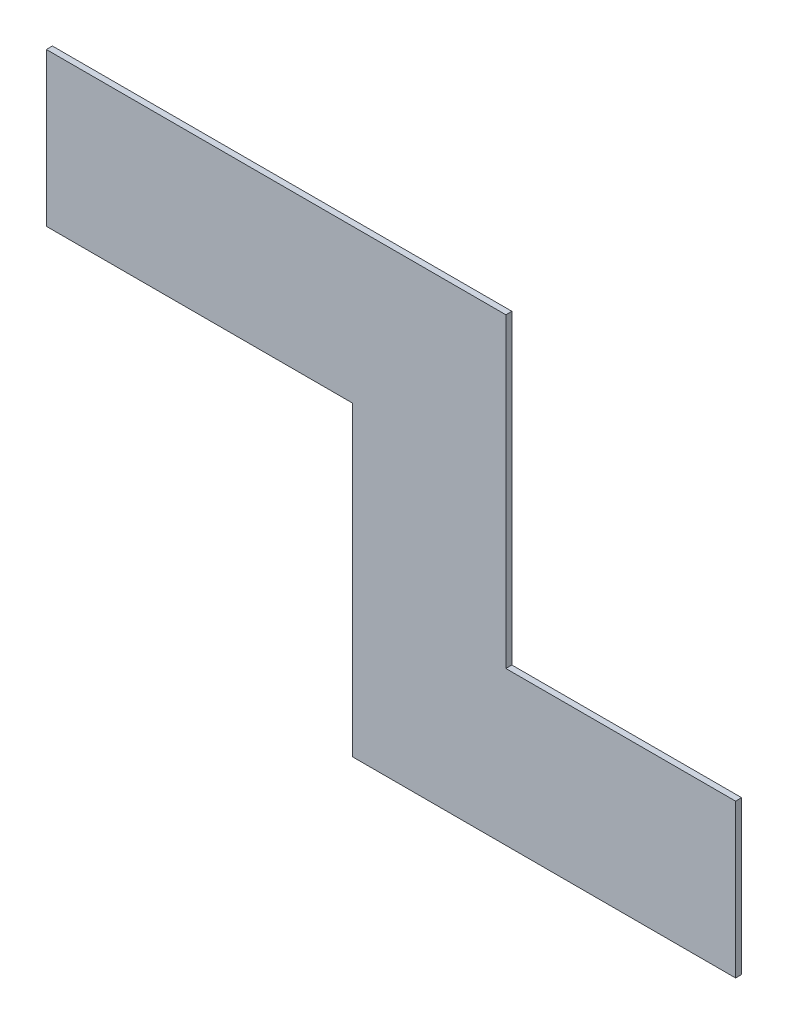
ISO-10303-21;
HEADER;
FILE_DESCRIPTION(('STEP AP214'),'2;1');
FILE_NAME('part.step','',(''),(''),'','','');
FILE_SCHEMA(('AUTOMOTIVE_DESIGN { 1 0 10303 214 1 1 1 1 }'));
ENDSEC;
DATA;
#1=APPLICATION_CONTEXT('core data for automotive mechanical design processes');
#2=APPLICATION_PROTOCOL_DEFINITION('international standard','automotive_design',2000,#1);
#3=PRODUCT_CONTEXT('',#1,'mechanical');
#4=PRODUCT('Part','Part','',(#3));
#5=PRODUCT_RELATED_PRODUCT_CATEGORY('part','',(#4));
#6=PRODUCT_DEFINITION_FORMATION('','',#4);
#7=PRODUCT_DEFINITION_CONTEXT('part definition',#1,'design');
#8=PRODUCT_DEFINITION('design','',#6,#7);
#9=PRODUCT_DEFINITION_SHAPE('','',#8);
#10=(LENGTH_UNIT() NAMED_UNIT(*) SI_UNIT(.MILLI.,.METRE.));
#11=(NAMED_UNIT(*) PLANE_ANGLE_UNIT() SI_UNIT($,.RADIAN.));
#12=(NAMED_UNIT(*) SI_UNIT($,.STERADIAN.) SOLID_ANGLE_UNIT());
#13=UNCERTAINTY_MEASURE_WITH_UNIT(LENGTH_MEASURE(1.E-05),#10,'distance_accuracy_value','');
#14=(GEOMETRIC_REPRESENTATION_CONTEXT(3) GLOBAL_UNCERTAINTY_ASSIGNED_CONTEXT((#13)) GLOBAL_UNIT_ASSIGNED_CONTEXT((#10,
#11,#12)) REPRESENTATION_CONTEXT('',''));
#15=CARTESIAN_POINT('',(0.,0.,0.));
#16=DIRECTION('',(0.,0.,1.));
#17=DIRECTION('',(1.,0.,0.));
#18=AXIS2_PLACEMENT_3D('',#15,#16,#17);
#19=CARTESIAN_POINT('',(0.5715,-0.127,0.01));
#20=DIRECTION('',(0.,0.,1.));
#21=DIRECTION('',(1.,0.,0.));
#22=AXIS2_PLACEMENT_3D('',#19,#20,#21);
#23=PLANE('',#22);
#24=DIRECTION('',(1.,0.,0.));
#25=VECTOR('',#24,1.);
#26=CARTESIAN_POINT('',(-0.0635,-0.381,0.01));
#27=LINE('',#26,#25);
#28=CARTESIAN_POINT('',(-0.0635,-0.381,0.01));
#29=VERTEX_POINT('',#28);
#30=CARTESIAN_POINT('',(0.5715,-0.381,0.01));
#31=VERTEX_POINT('',#30);
#32=EDGE_CURVE('E120',#29,#31,#27,.T.);
#33=ORIENTED_EDGE('',*,*,#32,.T.);
#34=DIRECTION('',(0.,1.,0.));
#35=VECTOR('',#34,1.);
#36=CARTESIAN_POINT('',(0.5715,-0.381,0.01));
#37=LINE('',#36,#35);
#38=CARTESIAN_POINT('',(0.5715,-0.127,0.01));
#39=VERTEX_POINT('',#38);
#40=EDGE_CURVE('E82',#31,#39,#37,.T.);
#41=ORIENTED_EDGE('',*,*,#40,.T.);
#42=DIRECTION('',(1.,0.,0.));
#43=VECTOR('',#42,1.);
#44=CARTESIAN_POINT('',(0.5715,-0.127,0.01));
#45=LINE('',#44,#43);
#46=CARTESIAN_POINT('',(0.1905,-0.127,0.01));
#47=VERTEX_POINT('',#46);
#48=EDGE_CURVE('E20',#39,#47,#45,.F.);
#49=ORIENTED_EDGE('',*,*,#48,.T.);
#50=DIRECTION('',(0.,1.,0.));
#51=VECTOR('',#50,1.);
#52=CARTESIAN_POINT('',(0.1905,-0.127,0.01));
#53=LINE('',#52,#51);
#54=CARTESIAN_POINT('',(0.1905,0.381,0.01));
#55=VERTEX_POINT('',#54);
#56=EDGE_CURVE('E79',#47,#55,#53,.T.);
#57=ORIENTED_EDGE('',*,*,#56,.T.);
#58=DIRECTION('',(1.,0.,0.));
#59=VECTOR('',#58,1.);
#60=CARTESIAN_POINT('',(0.1905,0.381,0.01));
#61=LINE('',#60,#59);
#62=CARTESIAN_POINT('',(-0.5715,0.381,0.01));
#63=VERTEX_POINT('',#62);
#64=EDGE_CURVE('E100',#55,#63,#61,.F.);
#65=ORIENTED_EDGE('',*,*,#64,.T.);
#66=DIRECTION('',(0.,1.,0.));
#67=VECTOR('',#66,1.);
#68=CARTESIAN_POINT('',(-0.5715,0.381,0.01));
#69=LINE('',#68,#67);
#70=CARTESIAN_POINT('',(-0.5715,0.127,0.01));
#71=VERTEX_POINT('',#70);
#72=EDGE_CURVE('E105',#63,#71,#69,.F.);
#73=ORIENTED_EDGE('',*,*,#72,.T.);
#74=DIRECTION('',(1.,0.,0.));
#75=VECTOR('',#74,1.);
#76=CARTESIAN_POINT('',(-0.5715,0.127,0.01));
#77=LINE('',#76,#75);
#78=CARTESIAN_POINT('',(-0.0635,0.127,0.01));
#79=VERTEX_POINT('',#78);
#80=EDGE_CURVE('E110',#71,#79,#77,.T.);
#81=ORIENTED_EDGE('',*,*,#80,.T.);
#82=DIRECTION('',(0.,1.,0.));
#83=VECTOR('',#82,1.);
#84=CARTESIAN_POINT('',(-0.0635,0.127,0.01));
#85=LINE('',#84,#83);
#86=EDGE_CURVE('E115',#79,#29,#85,.F.);
#87=ORIENTED_EDGE('',*,*,#86,.T.);
#88=EDGE_LOOP('',(#33,#41,#49,#57,#65,#73,#81,#87));
#89=FACE_BOUND('',#88,.T.);
#90=ADVANCED_FACE('F17',(#89),#23,.T.);
#91=CARTESIAN_POINT('',(0.5715,-0.127,0.));
#92=DIRECTION('',(0.,-1.,0.));
#93=DIRECTION('',(0.,0.,-1.));
#94=AXIS2_PLACEMENT_3D('',#91,#92,#93);
#95=PLANE('',#94);
#96=DIRECTION('',(0.,0.,1.));
#97=VECTOR('',#96,1.);
#98=CARTESIAN_POINT('',(0.1905,-0.127,0.));
#99=LINE('',#98,#97);
#100=CARTESIAN_POINT('',(0.1905,-0.127,0.));
#101=VERTEX_POINT('',#100);
#102=EDGE_CURVE('E87',#101,#47,#99,.T.);
#103=ORIENTED_EDGE('',*,*,#102,.T.);
#104=ORIENTED_EDGE('',*,*,#48,.F.);
#105=DIRECTION('',(0.,0.,1.));
#106=VECTOR('',#105,1.);
#107=CARTESIAN_POINT('',(0.5715,-0.127,0.));
#108=LINE('',#107,#106);
#109=CARTESIAN_POINT('',(0.5715,-0.127,0.));
#110=VERTEX_POINT('',#109);
#111=EDGE_CURVE('E124',#39,#110,#108,.F.);
#112=ORIENTED_EDGE('',*,*,#111,.T.);
#113=DIRECTION('',(1.,0.,0.));
#114=VECTOR('',#113,1.);
#115=CARTESIAN_POINT('',(0.5715,-0.127,0.));
#116=LINE('',#115,#114);
#117=EDGE_CURVE('E97',#110,#101,#116,.F.);
#118=ORIENTED_EDGE('',*,*,#117,.T.);
#119=EDGE_LOOP('',(#103,#104,#112,#118));
#120=FACE_BOUND('',#119,.T.);
#121=ADVANCED_FACE('F96',(#120),#95,.F.);
#122=CARTESIAN_POINT('',(0.1905,-0.127,0.));
#123=DIRECTION('',(-1.,0.,0.));
#124=DIRECTION('',(0.,0.,1.));
#125=AXIS2_PLACEMENT_3D('',#122,#123,#124);
#126=PLANE('',#125);
#127=DIRECTION('',(0.,0.,-1.));
#128=VECTOR('',#127,1.);
#129=CARTESIAN_POINT('',(0.1905,0.381,0.));
#130=LINE('',#129,#128);
#131=CARTESIAN_POINT('',(0.1905,0.381,0.));
#132=VERTEX_POINT('',#131);
#133=EDGE_CURVE('E93',#132,#55,#130,.F.);
#134=ORIENTED_EDGE('',*,*,#133,.T.);
#135=ORIENTED_EDGE('',*,*,#56,.F.);
#136=ORIENTED_EDGE('',*,*,#102,.F.);
#137=DIRECTION('',(0.,1.,0.));
#138=VECTOR('',#137,1.);
#139=CARTESIAN_POINT('',(0.1905,-0.127,0.));
#140=LINE('',#139,#138);
#141=EDGE_CURVE('E127',#101,#132,#140,.T.);
#142=ORIENTED_EDGE('',*,*,#141,.T.);
#143=EDGE_LOOP('',(#134,#135,#136,#142));
#144=FACE_BOUND('',#143,.T.);
#145=ADVANCED_FACE('F90',(#144),#126,.F.);
#146=CARTESIAN_POINT('',(0.1905,0.381,0.));
#147=DIRECTION('',(0.,-1.,0.));
#148=DIRECTION('',(0.,0.,-1.));
#149=AXIS2_PLACEMENT_3D('',#146,#147,#148);
#150=PLANE('',#149);
#151=DIRECTION('',(0.,0.,-1.));
#152=VECTOR('',#151,1.);
#153=CARTESIAN_POINT('',(-0.5715,0.381,0.));
#154=LINE('',#153,#152);
#155=CARTESIAN_POINT('',(-0.5715,0.381,0.));
#156=VERTEX_POINT('',#155);
#157=EDGE_CURVE('E102',#156,#63,#154,.F.);
#158=ORIENTED_EDGE('',*,*,#157,.T.);
#159=ORIENTED_EDGE('',*,*,#64,.F.);
#160=ORIENTED_EDGE('',*,*,#133,.F.);
#161=DIRECTION('',(1.,0.,0.));
#162=VECTOR('',#161,1.);
#163=CARTESIAN_POINT('',(0.5715,0.381,0.));
#164=LINE('',#163,#162);
#165=EDGE_CURVE('E129',#132,#156,#164,.F.);
#166=ORIENTED_EDGE('',*,*,#165,.T.);
#167=EDGE_LOOP('',(#158,#159,#160,#166));
#168=FACE_BOUND('',#167,.T.);
#169=ADVANCED_FACE('F162',(#168),#150,.F.);
#170=CARTESIAN_POINT('',(-0.5715,0.381,0.));
#171=DIRECTION('',(1.,0.,0.));
#172=DIRECTION('',(0.,0.,-1.));
#173=AXIS2_PLACEMENT_3D('',#170,#171,#172);
#174=PLANE('',#173);
#175=DIRECTION('',(0.,0.,1.));
#176=VECTOR('',#175,1.);
#177=CARTESIAN_POINT('',(-0.5715,0.127,0.));
#178=LINE('',#177,#176);
#179=CARTESIAN_POINT('',(-0.5715,0.127,0.));
#180=VERTEX_POINT('',#179);
#181=EDGE_CURVE('E107',#180,#71,#178,.T.);
#182=ORIENTED_EDGE('',*,*,#181,.T.);
#183=ORIENTED_EDGE('',*,*,#72,.F.);
#184=ORIENTED_EDGE('',*,*,#157,.F.);
#185=DIRECTION('',(0.,1.,0.));
#186=VECTOR('',#185,1.);
#187=CARTESIAN_POINT('',(-0.5715,-0.127,0.));
#188=LINE('',#187,#186);
#189=EDGE_CURVE('E132',#156,#180,#188,.F.);
#190=ORIENTED_EDGE('',*,*,#189,.T.);
#191=EDGE_LOOP('',(#182,#183,#184,#190));
#192=FACE_BOUND('',#191,.T.);
#193=ADVANCED_FACE('F159',(#192),#174,.F.);
#194=CARTESIAN_POINT('',(-0.5715,0.127,0.));
#195=DIRECTION('',(0.,1.,0.));
#196=DIRECTION('',(0.,0.,1.));
#197=AXIS2_PLACEMENT_3D('',#194,#195,#196);
#198=PLANE('',#197);
#199=DIRECTION('',(0.,0.,-1.));
#200=VECTOR('',#199,1.);
#201=CARTESIAN_POINT('',(-0.0635,0.127,0.));
#202=LINE('',#201,#200);
#203=CARTESIAN_POINT('',(-0.0635,0.127,0.));
#204=VERTEX_POINT('',#203);
#205=EDGE_CURVE('E112',#204,#79,#202,.F.);
#206=ORIENTED_EDGE('',*,*,#205,.T.);
#207=ORIENTED_EDGE('',*,*,#80,.F.);
#208=ORIENTED_EDGE('',*,*,#181,.F.);
#209=DIRECTION('',(1.,0.,0.));
#210=VECTOR('',#209,1.);
#211=CARTESIAN_POINT('',(0.5715,0.127,0.));
#212=LINE('',#211,#210);
#213=EDGE_CURVE('E135',#180,#204,#212,.T.);
#214=ORIENTED_EDGE('',*,*,#213,.T.);
#215=EDGE_LOOP('',(#206,#207,#208,#214));
#216=FACE_BOUND('',#215,.T.);
#217=ADVANCED_FACE('F155',(#216),#198,.F.);
#218=CARTESIAN_POINT('',(-0.0635,0.127,0.));
#219=DIRECTION('',(1.,0.,0.));
#220=DIRECTION('',(0.,0.,-1.));
#221=AXIS2_PLACEMENT_3D('',#218,#219,#220);
#222=PLANE('',#221);
#223=DIRECTION('',(0.,0.,1.));
#224=VECTOR('',#223,1.);
#225=CARTESIAN_POINT('',(-0.0635,-0.381,0.));
#226=LINE('',#225,#224);
#227=CARTESIAN_POINT('',(-0.0635,-0.381,0.));
#228=VERTEX_POINT('',#227);
#229=EDGE_CURVE('E117',#228,#29,#226,.T.);
#230=ORIENTED_EDGE('',*,*,#229,.T.);
#231=ORIENTED_EDGE('',*,*,#86,.F.);
#232=ORIENTED_EDGE('',*,*,#205,.F.);
#233=DIRECTION('',(0.,1.,0.));
#234=VECTOR('',#233,1.);
#235=CARTESIAN_POINT('',(-0.0635,-0.127,0.));
#236=LINE('',#235,#234);
#237=EDGE_CURVE('E138',#204,#228,#236,.F.);
#238=ORIENTED_EDGE('',*,*,#237,.T.);
#239=EDGE_LOOP('',(#230,#231,#232,#238));
#240=FACE_BOUND('',#239,.T.);
#241=ADVANCED_FACE('F151',(#240),#222,.F.);
#242=CARTESIAN_POINT('',(-0.0635,-0.381,0.));
#243=DIRECTION('',(0.,1.,0.));
#244=DIRECTION('',(0.,0.,1.));
#245=AXIS2_PLACEMENT_3D('',#242,#243,#244);
#246=PLANE('',#245);
#247=DIRECTION('',(0.,0.,1.));
#248=VECTOR('',#247,1.);
#249=CARTESIAN_POINT('',(0.5715,-0.381,0.));
#250=LINE('',#249,#248);
#251=CARTESIAN_POINT('',(0.5715,-0.381,0.));
#252=VERTEX_POINT('',#251);
#253=EDGE_CURVE('E34',#252,#31,#250,.T.);
#254=ORIENTED_EDGE('',*,*,#253,.T.);
#255=ORIENTED_EDGE('',*,*,#32,.F.);
#256=ORIENTED_EDGE('',*,*,#229,.F.);
#257=DIRECTION('',(1.,0.,0.));
#258=VECTOR('',#257,1.);
#259=CARTESIAN_POINT('',(0.5715,-0.381,0.));
#260=LINE('',#259,#258);
#261=EDGE_CURVE('E26',#228,#252,#260,.T.);
#262=ORIENTED_EDGE('',*,*,#261,.T.);
#263=EDGE_LOOP('',(#254,#255,#256,#262));
#264=FACE_BOUND('',#263,.T.);
#265=ADVANCED_FACE('F144',(#264),#246,.F.);
#266=CARTESIAN_POINT('',(0.5715,-0.381,0.));
#267=DIRECTION('',(-1.,0.,0.));
#268=DIRECTION('',(0.,0.,1.));
#269=AXIS2_PLACEMENT_3D('',#266,#267,#268);
#270=PLANE('',#269);
#271=ORIENTED_EDGE('',*,*,#111,.F.);
#272=ORIENTED_EDGE('',*,*,#40,.F.);
#273=ORIENTED_EDGE('',*,*,#253,.F.);
#274=DIRECTION('',(0.,1.,0.));
#275=VECTOR('',#274,1.);
#276=CARTESIAN_POINT('',(0.5715,-0.127,0.));
#277=LINE('',#276,#275);
#278=EDGE_CURVE('E11',#252,#110,#277,.T.);
#279=ORIENTED_EDGE('',*,*,#278,.T.);
#280=EDGE_LOOP('',(#271,#272,#273,#279));
#281=FACE_BOUND('',#280,.T.);
#282=ADVANCED_FACE('F163',(#281),#270,.F.);
#283=CARTESIAN_POINT('',(0.5715,-0.127,0.));
#284=DIRECTION('',(0.,0.,1.));
#285=DIRECTION('',(1.,0.,0.));
#286=AXIS2_PLACEMENT_3D('',#283,#284,#285);
#287=PLANE('',#286);
#288=ORIENTED_EDGE('',*,*,#261,.F.);
#289=ORIENTED_EDGE('',*,*,#237,.F.);
#290=ORIENTED_EDGE('',*,*,#213,.F.);
#291=ORIENTED_EDGE('',*,*,#189,.F.);
#292=ORIENTED_EDGE('',*,*,#165,.F.);
#293=ORIENTED_EDGE('',*,*,#141,.F.);
#294=ORIENTED_EDGE('',*,*,#117,.F.);
#295=ORIENTED_EDGE('',*,*,#278,.F.);
#296=EDGE_LOOP('',(#288,#289,#290,#291,#292,#293,#294,#295));
#297=FACE_BOUND('',#296,.T.);
#298=ADVANCED_FACE('F148',(#297),#287,.F.);
#299=CLOSED_SHELL('',(#90,#121,#145,#169,#193,#217,#241,#265,#282,#298));
#300=MANIFOLD_SOLID_BREP('B1',#299);
#301=ADVANCED_BREP_SHAPE_REPRESENTATION('',(#18,#300),#14);
#302=SHAPE_DEFINITION_REPRESENTATION(#9,#301);
ENDSEC;
END-ISO-10303-21;
